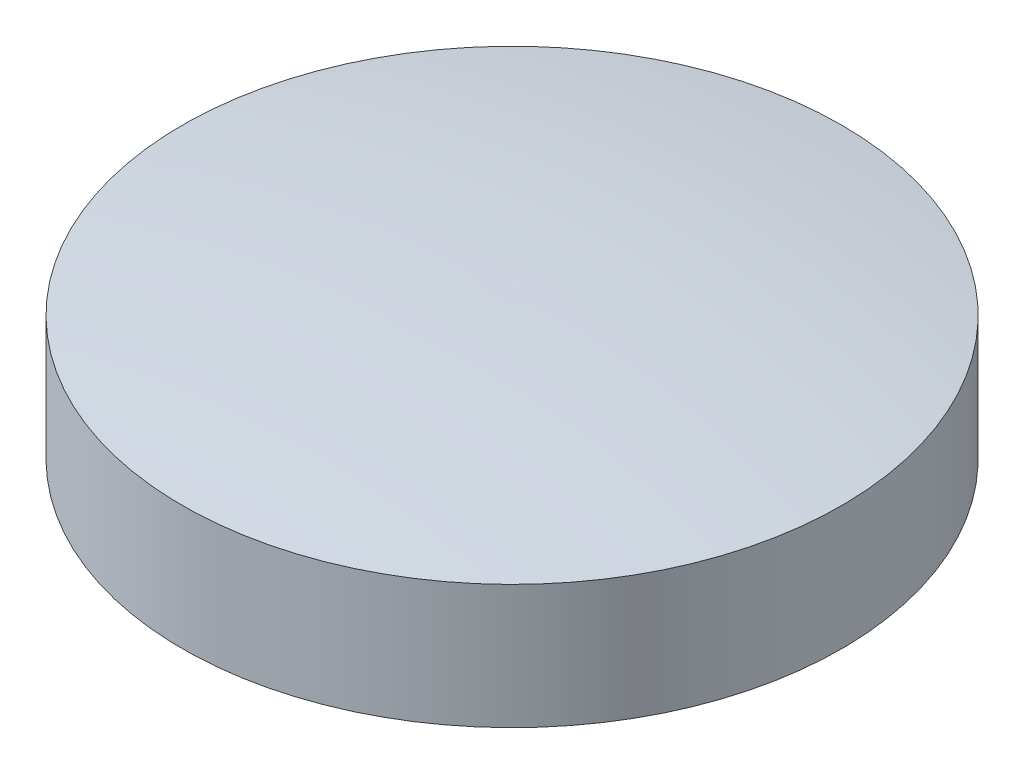
ISO-10303-21;
HEADER;
FILE_DESCRIPTION(('STEP AP214'),'2;1');
FILE_NAME('part.step','',(''),(''),'','','');
FILE_SCHEMA(('AUTOMOTIVE_DESIGN { 1 0 10303 214 1 1 1 1 }'));
ENDSEC;
DATA;
#1=APPLICATION_CONTEXT('core data for automotive mechanical design processes');
#2=APPLICATION_PROTOCOL_DEFINITION('international standard','automotive_design',2000,#1);
#3=PRODUCT_CONTEXT('',#1,'mechanical');
#4=PRODUCT('Part','Part','',(#3));
#5=PRODUCT_RELATED_PRODUCT_CATEGORY('part','',(#4));
#6=PRODUCT_DEFINITION_FORMATION('','',#4);
#7=PRODUCT_DEFINITION_CONTEXT('part definition',#1,'design');
#8=PRODUCT_DEFINITION('design','',#6,#7);
#9=PRODUCT_DEFINITION_SHAPE('','',#8);
#10=(LENGTH_UNIT() NAMED_UNIT(*) SI_UNIT(.MILLI.,.METRE.));
#11=(NAMED_UNIT(*) PLANE_ANGLE_UNIT() SI_UNIT($,.RADIAN.));
#12=(NAMED_UNIT(*) SI_UNIT($,.STERADIAN.) SOLID_ANGLE_UNIT());
#13=UNCERTAINTY_MEASURE_WITH_UNIT(LENGTH_MEASURE(1.E-05),#10,'distance_accuracy_value','');
#14=(GEOMETRIC_REPRESENTATION_CONTEXT(3) GLOBAL_UNCERTAINTY_ASSIGNED_CONTEXT((#13)) GLOBAL_UNIT_ASSIGNED_CONTEXT((#10,
#11,#12)) REPRESENTATION_CONTEXT('',''));
#15=CARTESIAN_POINT('',(0.,0.,0.));
#16=DIRECTION('',(0.,0.,1.));
#17=DIRECTION('',(1.,0.,0.));
#18=AXIS2_PLACEMENT_3D('',#15,#16,#17);
#19=CARTESIAN_POINT('',(0.,0.,0.));
#20=DIRECTION('',(0.,-1.,0.));
#21=DIRECTION('',(0.,0.,-1.));
#22=AXIS2_PLACEMENT_3D('',#19,#20,#21);
#23=PLANE('',#22);
#24=CARTESIAN_POINT('',(0.,0.,0.));
#25=DIRECTION('',(0.,-1.,0.));
#26=DIRECTION('',(0.,0.,-1.));
#27=AXIS2_PLACEMENT_3D('',#24,#25,#26);
#28=CIRCLE('',#27,25.5);
#29=CARTESIAN_POINT('',(0.,0.,-25.5));
#30=VERTEX_POINT('',#29);
#31=EDGE_CURVE('E11',#30,#30,#28,.T.);
#32=ORIENTED_EDGE('',*,*,#31,.T.);
#33=EDGE_LOOP('',(#32));
#34=FACE_BOUND('',#33,.T.);
#35=ADVANCED_FACE('F36',(#34),#23,.T.);
#36=CARTESIAN_POINT('',(0.,0.,0.));
#37=DIRECTION('',(0.,-1.,0.));
#38=DIRECTION('',(0.,0.,-1.));
#39=AXIS2_PLACEMENT_3D('',#36,#37,#38);
#40=CYLINDRICAL_SURFACE('',#39,25.5);
#41=CARTESIAN_POINT('',(0.,9.6,0.));
#42=DIRECTION('',(0.,-1.,0.));
#43=DIRECTION('',(0.,0.,-1.));
#44=AXIS2_PLACEMENT_3D('',#41,#42,#43);
#45=CIRCLE('',#44,25.5);
#46=CARTESIAN_POINT('',(0.,9.6,-25.5));
#47=VERTEX_POINT('',#46);
#48=EDGE_CURVE('E42',#47,#47,#45,.T.);
#49=ORIENTED_EDGE('',*,*,#48,.T.);
#50=EDGE_LOOP('',(#49));
#51=FACE_BOUND('',#50,.T.);
#52=ORIENTED_EDGE('',*,*,#31,.F.);
#53=EDGE_LOOP('',(#52));
#54=FACE_BOUND('',#53,.T.);
#55=ADVANCED_FACE('F48',(#51,#54),#40,.T.);
#56=CARTESIAN_POINT('',(0.,-145.385066423705,-1.03378672761593));
#57=DIRECTION('',(-1.,0.,0.));
#58=DIRECTION('',(0.,0.,-1.));
#59=AXIS2_PLACEMENT_3D('',#56,#57,#58);
#60=CIRCLE('',#59,156.904322458784);
#61=TRIMMED_CURVE('',#60,(PARAMETER_VALUE(-1.57738501849598)),
(PARAMETER_VALUE(1.57738501849598)),.T.,.PARAMETER.);
#62=CARTESIAN_POINT('',(0.,-145.385066423705,0.));
#63=DIRECTION('',(0.,-1.,0.));
#64=AXIS1_PLACEMENT('',#62,#63);
#65=SURFACE_OF_REVOLUTION('',#61,#64);
#66=CARTESIAN_POINT('',(0.,11.5158503717422,0.));
#67=VERTEX_POINT('',#66);
#68=VERTEX_LOOP('',#67);
#69=FACE_BOUND('',#68,.T.);
#70=ORIENTED_EDGE('',*,*,#48,.F.);
#71=EDGE_LOOP('',(#70));
#72=FACE_BOUND('',#71,.T.);
#73=ADVANCED_FACE('F45',(#69,#72),#65,.T.);
#74=CLOSED_SHELL('',(#35,#55,#73));
#75=MANIFOLD_SOLID_BREP('B2',#74);
#76=ADVANCED_BREP_SHAPE_REPRESENTATION('',(#18,#75),#14);
#77=SHAPE_DEFINITION_REPRESENTATION(#9,#76);
ENDSEC;
END-ISO-10303-21;
